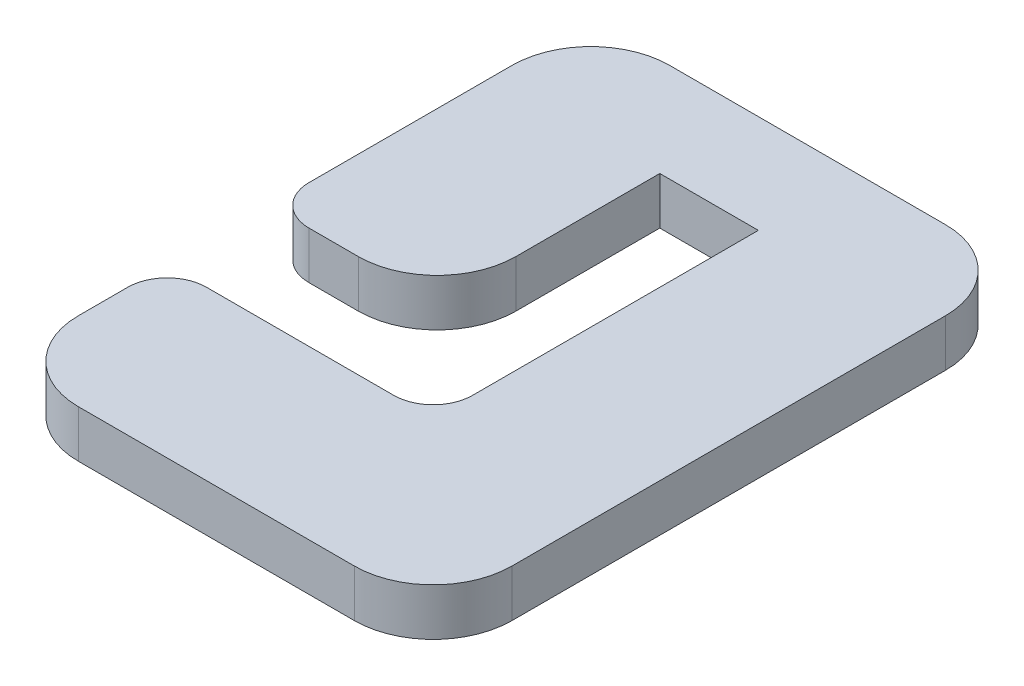
ISO-10303-21;
HEADER;
FILE_DESCRIPTION(('STEP AP214'),'2;1');
FILE_NAME('part.step','',(''),(''),'','','');
FILE_SCHEMA(('AUTOMOTIVE_DESIGN { 1 0 10303 214 1 1 1 1 }'));
ENDSEC;
DATA;
#1=APPLICATION_CONTEXT('core data for automotive mechanical design processes');
#2=APPLICATION_PROTOCOL_DEFINITION('international standard','automotive_design',2000,#1);
#3=PRODUCT_CONTEXT('',#1,'mechanical');
#4=PRODUCT('Part','Part','',(#3));
#5=PRODUCT_RELATED_PRODUCT_CATEGORY('part','',(#4));
#6=PRODUCT_DEFINITION_FORMATION('','',#4);
#7=PRODUCT_DEFINITION_CONTEXT('part definition',#1,'design');
#8=PRODUCT_DEFINITION('design','',#6,#7);
#9=PRODUCT_DEFINITION_SHAPE('','',#8);
#10=(LENGTH_UNIT() NAMED_UNIT(*) SI_UNIT(.MILLI.,.METRE.));
#11=(NAMED_UNIT(*) PLANE_ANGLE_UNIT() SI_UNIT($,.RADIAN.));
#12=(NAMED_UNIT(*) SI_UNIT($,.STERADIAN.) SOLID_ANGLE_UNIT());
#13=UNCERTAINTY_MEASURE_WITH_UNIT(LENGTH_MEASURE(1.E-05),#10,'distance_accuracy_value','');
#14=(GEOMETRIC_REPRESENTATION_CONTEXT(3) GLOBAL_UNCERTAINTY_ASSIGNED_CONTEXT((#13)) GLOBAL_UNIT_ASSIGNED_CONTEXT((#10,
#11,#12)) REPRESENTATION_CONTEXT('',''));
#15=CARTESIAN_POINT('',(0.,0.,0.));
#16=DIRECTION('',(0.,0.,1.));
#17=DIRECTION('',(1.,0.,0.));
#18=AXIS2_PLACEMENT_3D('',#15,#16,#17);
#19=CARTESIAN_POINT('',(11.,2.4,15.));
#20=DIRECTION('',(-1.,0.,0.));
#21=DIRECTION('',(0.,0.,1.));
#22=AXIS2_PLACEMENT_3D('',#19,#20,#21);
#23=PLANE('',#22);
#24=DIRECTION('',(0.,0.,-1.));
#25=VECTOR('',#24,1.);
#26=CARTESIAN_POINT('',(11.,2.4,15.));
#27=LINE('',#26,#25);
#28=CARTESIAN_POINT('',(11.,2.4,11.));
#29=VERTEX_POINT('',#28);
#30=CARTESIAN_POINT('',(11.,2.4,-11.));
#31=VERTEX_POINT('',#30);
#32=EDGE_CURVE('E244',#29,#31,#27,.T.);
#33=ORIENTED_EDGE('',*,*,#32,.F.);
#34=DIRECTION('',(0.,-1.,0.));
#35=VECTOR('',#34,1.);
#36=CARTESIAN_POINT('',(11.,2.4,11.));
#37=LINE('',#36,#35);
#38=CARTESIAN_POINT('',(11.,0.,11.));
#39=VERTEX_POINT('',#38);
#40=EDGE_CURVE('E298',#29,#39,#37,.T.);
#41=ORIENTED_EDGE('',*,*,#40,.T.);
#42=DIRECTION('',(0.,0.,-1.));
#43=VECTOR('',#42,1.);
#44=CARTESIAN_POINT('',(11.,0.,15.));
#45=LINE('',#44,#43);
#46=CARTESIAN_POINT('',(11.,0.,-11.));
#47=VERTEX_POINT('',#46);
#48=EDGE_CURVE('E210',#39,#47,#45,.T.);
#49=ORIENTED_EDGE('',*,*,#48,.T.);
#50=DIRECTION('',(0.,-1.,0.));
#51=VECTOR('',#50,1.);
#52=CARTESIAN_POINT('',(11.,2.4,-11.));
#53=LINE('',#52,#51);
#54=EDGE_CURVE('E295',#47,#31,#53,.F.);
#55=ORIENTED_EDGE('',*,*,#54,.T.);
#56=EDGE_LOOP('',(#33,#41,#49,#55));
#57=FACE_BOUND('',#56,.T.);
#58=ADVANCED_FACE('F38',(#57),#23,.F.);
#59=CARTESIAN_POINT('',(-11.,2.4,-15.));
#60=DIRECTION('',(0.,0.,1.));
#61=DIRECTION('',(1.,0.,0.));
#62=AXIS2_PLACEMENT_3D('',#59,#60,#61);
#63=PLANE('',#62);
#64=DIRECTION('',(-1.,0.,0.));
#65=VECTOR('',#64,1.);
#66=CARTESIAN_POINT('',(-11.,2.4,-15.));
#67=LINE('',#66,#65);
#68=CARTESIAN_POINT('',(7.,2.4,-15.));
#69=VERTEX_POINT('',#68);
#70=CARTESIAN_POINT('',(-7.,2.4,-15.));
#71=VERTEX_POINT('',#70);
#72=EDGE_CURVE('E388',#69,#71,#67,.T.);
#73=ORIENTED_EDGE('',*,*,#72,.F.);
#74=DIRECTION('',(0.,-1.,0.));
#75=VECTOR('',#74,1.);
#76=CARTESIAN_POINT('',(7.,2.4,-15.));
#77=LINE('',#76,#75);
#78=CARTESIAN_POINT('',(7.,0.,-15.));
#79=VERTEX_POINT('',#78);
#80=EDGE_CURVE('E305',#69,#79,#77,.T.);
#81=ORIENTED_EDGE('',*,*,#80,.T.);
#82=DIRECTION('',(-1.,0.,0.));
#83=VECTOR('',#82,1.);
#84=CARTESIAN_POINT('',(-11.,0.,-15.));
#85=LINE('',#84,#83);
#86=CARTESIAN_POINT('',(-7.,0.,-15.));
#87=VERTEX_POINT('',#86);
#88=EDGE_CURVE('E214',#79,#87,#85,.T.);
#89=ORIENTED_EDGE('',*,*,#88,.T.);
#90=DIRECTION('',(0.,-1.,0.));
#91=VECTOR('',#90,1.);
#92=CARTESIAN_POINT('',(-7.,2.4,-15.));
#93=LINE('',#92,#91);
#94=EDGE_CURVE('E302',#87,#71,#93,.F.);
#95=ORIENTED_EDGE('',*,*,#94,.T.);
#96=EDGE_LOOP('',(#73,#81,#89,#95));
#97=FACE_BOUND('',#96,.T.);
#98=ADVANCED_FACE('F413',(#97),#63,.F.);
#99=CARTESIAN_POINT('',(-11.,2.4,1.3));
#100=DIRECTION('',(1.,0.,0.));
#101=DIRECTION('',(0.,0.,-1.));
#102=AXIS2_PLACEMENT_3D('',#99,#100,#101);
#103=PLANE('',#102);
#104=DIRECTION('',(0.,0.,1.));
#105=VECTOR('',#104,1.);
#106=CARTESIAN_POINT('',(-11.,0.,1.3));
#107=LINE('',#106,#105);
#108=CARTESIAN_POINT('',(-11.,0.,-11.));
#109=VERTEX_POINT('',#108);
#110=CARTESIAN_POINT('',(-11.,0.,-0.699999999999996));
#111=VERTEX_POINT('',#110);
#112=EDGE_CURVE('E218',#109,#111,#107,.T.);
#113=ORIENTED_EDGE('',*,*,#112,.T.);
#114=DIRECTION('',(0.,-1.,0.));
#115=VECTOR('',#114,1.);
#116=CARTESIAN_POINT('',(-11.,2.4,-0.699999999999996));
#117=LINE('',#116,#115);
#118=CARTESIAN_POINT('',(-11.,2.4,-0.699999999999996));
#119=VERTEX_POINT('',#118);
#120=EDGE_CURVE('E62',#111,#119,#117,.F.);
#121=ORIENTED_EDGE('',*,*,#120,.T.);
#122=DIRECTION('',(0.,0.,1.));
#123=VECTOR('',#122,1.);
#124=CARTESIAN_POINT('',(-11.,2.4,1.3));
#125=LINE('',#124,#123);
#126=CARTESIAN_POINT('',(-11.,2.4,-11.));
#127=VERTEX_POINT('',#126);
#128=EDGE_CURVE('E392',#127,#119,#125,.T.);
#129=ORIENTED_EDGE('',*,*,#128,.F.);
#130=DIRECTION('',(0.,-1.,0.));
#131=VECTOR('',#130,1.);
#132=CARTESIAN_POINT('',(-11.,2.4,-11.));
#133=LINE('',#132,#131);
#134=EDGE_CURVE('E309',#127,#109,#133,.T.);
#135=ORIENTED_EDGE('',*,*,#134,.T.);
#136=EDGE_LOOP('',(#113,#121,#129,#135));
#137=FACE_BOUND('',#136,.T.);
#138=ADVANCED_FACE('F406',(#137),#103,.F.);
#139=CARTESIAN_POINT('',(-2.5,2.4,1.3));
#140=DIRECTION('',(0.,0.,-1.));
#141=DIRECTION('',(-1.,0.,0.));
#142=AXIS2_PLACEMENT_3D('',#139,#140,#141);
#143=PLANE('',#142);
#144=DIRECTION('',(1.,0.,0.));
#145=VECTOR('',#144,1.);
#146=CARTESIAN_POINT('',(-2.5,2.4,1.3));
#147=LINE('',#146,#145);
#148=CARTESIAN_POINT('',(-9.,2.4,1.3));
#149=VERTEX_POINT('',#148);
#150=CARTESIAN_POINT('',(-6.5,2.4,1.3));
#151=VERTEX_POINT('',#150);
#152=EDGE_CURVE('E177',#149,#151,#147,.T.);
#153=ORIENTED_EDGE('',*,*,#152,.F.);
#154=DIRECTION('',(0.,-1.,0.));
#155=VECTOR('',#154,1.);
#156=CARTESIAN_POINT('',(-9.,2.4,1.3));
#157=LINE('',#156,#155);
#158=CARTESIAN_POINT('',(-9.,0.,1.3));
#159=VERTEX_POINT('',#158);
#160=EDGE_CURVE('E338',#149,#159,#157,.T.);
#161=ORIENTED_EDGE('',*,*,#160,.T.);
#162=DIRECTION('',(1.,0.,0.));
#163=VECTOR('',#162,1.);
#164=CARTESIAN_POINT('',(-2.5,0.,1.3));
#165=LINE('',#164,#163);
#166=CARTESIAN_POINT('',(-6.5,0.,1.3));
#167=VERTEX_POINT('',#166);
#168=EDGE_CURVE('E221',#159,#167,#165,.T.);
#169=ORIENTED_EDGE('',*,*,#168,.T.);
#170=DIRECTION('',(0.,-1.,0.));
#171=VECTOR('',#170,1.);
#172=CARTESIAN_POINT('',(-6.5,2.4,1.3));
#173=LINE('',#172,#171);
#174=EDGE_CURVE('E253',#167,#151,#173,.F.);
#175=ORIENTED_EDGE('',*,*,#174,.T.);
#176=EDGE_LOOP('',(#153,#161,#169,#175));
#177=FACE_BOUND('',#176,.T.);
#178=ADVANCED_FACE('F400',(#177),#143,.F.);
#179=CARTESIAN_POINT('',(-2.5,2.4,-10.));
#180=DIRECTION('',(-1.,0.,0.));
#181=DIRECTION('',(0.,0.,1.));
#182=AXIS2_PLACEMENT_3D('',#179,#180,#181);
#183=PLANE('',#182);
#184=DIRECTION('',(0.,0.,-1.));
#185=VECTOR('',#184,1.);
#186=CARTESIAN_POINT('',(-2.5,2.4,-10.));
#187=LINE('',#186,#185);
#188=CARTESIAN_POINT('',(-2.5,2.4,-2.7));
#189=VERTEX_POINT('',#188);
#190=CARTESIAN_POINT('',(-2.5,2.4,-10.));
#191=VERTEX_POINT('',#190);
#192=EDGE_CURVE('E163',#189,#191,#187,.T.);
#193=ORIENTED_EDGE('',*,*,#192,.F.);
#194=DIRECTION('',(0.,-1.,0.));
#195=VECTOR('',#194,1.);
#196=CARTESIAN_POINT('',(-2.5,2.4,-2.7));
#197=LINE('',#196,#195);
#198=CARTESIAN_POINT('',(-2.5,0.,-2.7));
#199=VERTEX_POINT('',#198);
#200=EDGE_CURVE('E187',#189,#199,#197,.T.);
#201=ORIENTED_EDGE('',*,*,#200,.T.);
#202=DIRECTION('',(0.,0.,-1.));
#203=VECTOR('',#202,1.);
#204=CARTESIAN_POINT('',(-2.5,0.,-10.));
#205=LINE('',#204,#203);
#206=CARTESIAN_POINT('',(-2.5,0.,-10.));
#207=VERTEX_POINT('',#206);
#208=EDGE_CURVE('E183',#199,#207,#205,.T.);
#209=ORIENTED_EDGE('',*,*,#208,.T.);
#210=DIRECTION('',(0.,-1.,0.));
#211=VECTOR('',#210,1.);
#212=CARTESIAN_POINT('',(-2.5,2.4,-10.));
#213=LINE('',#212,#211);
#214=EDGE_CURVE('E180',#191,#207,#213,.T.);
#215=ORIENTED_EDGE('',*,*,#214,.F.);
#216=EDGE_LOOP('',(#193,#201,#209,#215));
#217=FACE_BOUND('',#216,.T.);
#218=ADVANCED_FACE('F181',(#217),#183,.F.);
#219=CARTESIAN_POINT('',(-2.5,2.4,-10.));
#220=DIRECTION('',(0.,0.,-1.));
#221=DIRECTION('',(-1.,0.,0.));
#222=AXIS2_PLACEMENT_3D('',#219,#220,#221);
#223=PLANE('',#222);
#224=DIRECTION('',(1.,0.,0.));
#225=VECTOR('',#224,1.);
#226=CARTESIAN_POINT('',(-2.5,0.,-10.));
#227=LINE('',#226,#225);
#228=CARTESIAN_POINT('',(2.5,0.,-10.));
#229=VERTEX_POINT('',#228);
#230=EDGE_CURVE('E226',#207,#229,#227,.T.);
#231=ORIENTED_EDGE('',*,*,#230,.T.);
#232=DIRECTION('',(0.,-1.,0.));
#233=VECTOR('',#232,1.);
#234=CARTESIAN_POINT('',(2.5,2.4,-10.));
#235=LINE('',#234,#233);
#236=CARTESIAN_POINT('',(2.5,2.4,-10.));
#237=VERTEX_POINT('',#236);
#238=EDGE_CURVE('E188',#237,#229,#235,.T.);
#239=ORIENTED_EDGE('',*,*,#238,.F.);
#240=DIRECTION('',(1.,0.,0.));
#241=VECTOR('',#240,1.);
#242=CARTESIAN_POINT('',(-2.5,2.4,-10.));
#243=LINE('',#242,#241);
#244=EDGE_CURVE('E169',#191,#237,#243,.T.);
#245=ORIENTED_EDGE('',*,*,#244,.F.);
#246=ORIENTED_EDGE('',*,*,#214,.T.);
#247=EDGE_LOOP('',(#231,#239,#245,#246));
#248=FACE_BOUND('',#247,.T.);
#249=ADVANCED_FACE('F190',(#248),#223,.F.);
#250=CARTESIAN_POINT('',(2.5,2.4,-10.));
#251=DIRECTION('',(1.,0.,0.));
#252=DIRECTION('',(0.,0.,-1.));
#253=AXIS2_PLACEMENT_3D('',#250,#251,#252);
#254=PLANE('',#253);
#255=DIRECTION('',(0.,0.,1.));
#256=VECTOR('',#255,1.);
#257=CARTESIAN_POINT('',(2.5,0.,-10.));
#258=LINE('',#257,#256);
#259=CARTESIAN_POINT('',(2.5,0.,4.5));
#260=VERTEX_POINT('',#259);
#261=EDGE_CURVE('E229',#229,#260,#258,.T.);
#262=ORIENTED_EDGE('',*,*,#261,.T.);
#263=DIRECTION('',(0.,-1.,0.));
#264=VECTOR('',#263,1.);
#265=CARTESIAN_POINT('',(2.5,2.4,4.5));
#266=LINE('',#265,#264);
#267=CARTESIAN_POINT('',(2.5,2.4,4.5));
#268=VERTEX_POINT('',#267);
#269=EDGE_CURVE('E320',#260,#268,#266,.F.);
#270=ORIENTED_EDGE('',*,*,#269,.T.);
#271=DIRECTION('',(0.,0.,1.));
#272=VECTOR('',#271,1.);
#273=CARTESIAN_POINT('',(2.5,2.4,-10.));
#274=LINE('',#273,#272);
#275=EDGE_CURVE('E194',#237,#268,#274,.T.);
#276=ORIENTED_EDGE('',*,*,#275,.F.);
#277=ORIENTED_EDGE('',*,*,#238,.T.);
#278=EDGE_LOOP('',(#262,#270,#276,#277));
#279=FACE_BOUND('',#278,.T.);
#280=ADVANCED_FACE('F353',(#279),#254,.F.);
#281=CARTESIAN_POINT('',(-2.5,2.4,6.5));
#282=DIRECTION('',(0.,0.,1.));
#283=DIRECTION('',(1.,0.,0.));
#284=AXIS2_PLACEMENT_3D('',#281,#282,#283);
#285=PLANE('',#284);
#286=DIRECTION('',(-1.,0.,0.));
#287=VECTOR('',#286,1.);
#288=CARTESIAN_POINT('',(-2.5,2.4,6.5));
#289=LINE('',#288,#287);
#290=CARTESIAN_POINT('',(0.5,2.4,6.5));
#291=VERTEX_POINT('',#290);
#292=CARTESIAN_POINT('',(-9.,2.4,6.50000000000001));
#293=VERTEX_POINT('',#292);
#294=EDGE_CURVE('E197',#291,#293,#289,.T.);
#295=ORIENTED_EDGE('',*,*,#294,.F.);
#296=DIRECTION('',(0.,-1.,0.));
#297=VECTOR('',#296,1.);
#298=CARTESIAN_POINT('',(0.5,0.,6.5));
#299=LINE('',#298,#297);
#300=CARTESIAN_POINT('',(0.5,0.,6.5));
#301=VERTEX_POINT('',#300);
#302=EDGE_CURVE('E316',#291,#301,#299,.T.);
#303=ORIENTED_EDGE('',*,*,#302,.T.);
#304=DIRECTION('',(-1.,0.,0.));
#305=VECTOR('',#304,1.);
#306=CARTESIAN_POINT('',(-2.5,0.,6.5));
#307=LINE('',#306,#305);
#308=CARTESIAN_POINT('',(-9.,0.,6.5));
#309=VERTEX_POINT('',#308);
#310=EDGE_CURVE('E233',#301,#309,#307,.T.);
#311=ORIENTED_EDGE('',*,*,#310,.T.);
#312=DIRECTION('',(0.,-1.,0.));
#313=VECTOR('',#312,1.);
#314=CARTESIAN_POINT('',(-9.,2.4,6.5));
#315=LINE('',#314,#313);
#316=EDGE_CURVE('E313',#309,#293,#315,.F.);
#317=ORIENTED_EDGE('',*,*,#316,.T.);
#318=EDGE_LOOP('',(#295,#303,#311,#317));
#319=FACE_BOUND('',#318,.T.);
#320=ADVANCED_FACE('F359',(#319),#285,.F.);
#321=CARTESIAN_POINT('',(-11.,2.4,15.));
#322=DIRECTION('',(1.,0.,0.));
#323=DIRECTION('',(0.,0.,-1.));
#324=AXIS2_PLACEMENT_3D('',#321,#322,#323);
#325=PLANE('',#324);
#326=DIRECTION('',(0.,0.,1.));
#327=VECTOR('',#326,1.);
#328=CARTESIAN_POINT('',(-11.,2.4,15.));
#329=LINE('',#328,#327);
#330=CARTESIAN_POINT('',(-11.,2.4,8.5));
#331=VERTEX_POINT('',#330);
#332=CARTESIAN_POINT('',(-11.,2.4,11.));
#333=VERTEX_POINT('',#332);
#334=EDGE_CURVE('E203',#331,#333,#329,.T.);
#335=ORIENTED_EDGE('',*,*,#334,.F.);
#336=DIRECTION('',(0.,-1.,0.));
#337=VECTOR('',#336,1.);
#338=CARTESIAN_POINT('',(-11.,2.4,8.5));
#339=LINE('',#338,#337);
#340=CARTESIAN_POINT('',(-11.,0.,8.5));
#341=VERTEX_POINT('',#340);
#342=EDGE_CURVE('E323',#331,#341,#339,.T.);
#343=ORIENTED_EDGE('',*,*,#342,.T.);
#344=DIRECTION('',(0.,0.,1.));
#345=VECTOR('',#344,1.);
#346=CARTESIAN_POINT('',(-11.,0.,15.));
#347=LINE('',#346,#345);
#348=CARTESIAN_POINT('',(-11.,0.,11.));
#349=VERTEX_POINT('',#348);
#350=EDGE_CURVE('E237',#341,#349,#347,.T.);
#351=ORIENTED_EDGE('',*,*,#350,.T.);
#352=DIRECTION('',(0.,-1.,0.));
#353=VECTOR('',#352,1.);
#354=CARTESIAN_POINT('',(-11.,2.4,11.));
#355=LINE('',#354,#353);
#356=EDGE_CURVE('E279',#349,#333,#355,.F.);
#357=ORIENTED_EDGE('',*,*,#356,.T.);
#358=EDGE_LOOP('',(#335,#343,#351,#357));
#359=FACE_BOUND('',#358,.T.);
#360=ADVANCED_FACE('F366',(#359),#325,.F.);
#361=CARTESIAN_POINT('',(-11.,2.4,15.));
#362=DIRECTION('',(0.,0.,-1.));
#363=DIRECTION('',(-1.,0.,0.));
#364=AXIS2_PLACEMENT_3D('',#361,#362,#363);
#365=PLANE('',#364);
#366=DIRECTION('',(1.,0.,0.));
#367=VECTOR('',#366,1.);
#368=CARTESIAN_POINT('',(-11.,2.4,15.));
#369=LINE('',#368,#367);
#370=CARTESIAN_POINT('',(-7.,2.4,15.));
#371=VERTEX_POINT('',#370);
#372=CARTESIAN_POINT('',(7.,2.4,15.));
#373=VERTEX_POINT('',#372);
#374=EDGE_CURVE('E206',#371,#373,#369,.T.);
#375=ORIENTED_EDGE('',*,*,#374,.F.);
#376=DIRECTION('',(0.,-1.,0.));
#377=VECTOR('',#376,1.);
#378=CARTESIAN_POINT('',(-7.,2.4,15.));
#379=LINE('',#378,#377);
#380=CARTESIAN_POINT('',(-7.,0.,15.));
#381=VERTEX_POINT('',#380);
#382=EDGE_CURVE('E262',#371,#381,#379,.T.);
#383=ORIENTED_EDGE('',*,*,#382,.T.);
#384=DIRECTION('',(1.,0.,0.));
#385=VECTOR('',#384,1.);
#386=CARTESIAN_POINT('',(-11.,0.,15.));
#387=LINE('',#386,#385);
#388=CARTESIAN_POINT('',(7.,0.,15.));
#389=VERTEX_POINT('',#388);
#390=EDGE_CURVE('E240',#381,#389,#387,.T.);
#391=ORIENTED_EDGE('',*,*,#390,.T.);
#392=DIRECTION('',(0.,-1.,0.));
#393=VECTOR('',#392,1.);
#394=CARTESIAN_POINT('',(7.,2.4,15.));
#395=LINE('',#394,#393);
#396=EDGE_CURVE('E259',#389,#373,#395,.F.);
#397=ORIENTED_EDGE('',*,*,#396,.T.);
#398=EDGE_LOOP('',(#375,#383,#391,#397));
#399=FACE_BOUND('',#398,.T.);
#400=ADVANCED_FACE('F375',(#399),#365,.F.);
#401=CARTESIAN_POINT('',(0.,2.4,0.));
#402=DIRECTION('',(0.,-1.,0.));
#403=DIRECTION('',(0.,0.,-1.));
#404=AXIS2_PLACEMENT_3D('',#401,#402,#403);
#405=PLANE('',#404);
#406=ORIENTED_EDGE('',*,*,#294,.T.);
#407=CARTESIAN_POINT('',(-9.,2.4,8.5));
#408=DIRECTION('',(0.,-1.,0.));
#409=DIRECTION('',(0.,0.,-1.));
#410=AXIS2_PLACEMENT_3D('',#407,#408,#409);
#411=CIRCLE('',#410,2.);
#412=EDGE_CURVE('E335',#293,#331,#411,.F.);
#413=ORIENTED_EDGE('',*,*,#412,.T.);
#414=ORIENTED_EDGE('',*,*,#334,.T.);
#415=CARTESIAN_POINT('',(-7.,2.4,11.));
#416=DIRECTION('',(0.,-1.,0.));
#417=DIRECTION('',(0.,0.,-1.));
#418=AXIS2_PLACEMENT_3D('',#415,#416,#417);
#419=CIRCLE('',#418,4.);
#420=EDGE_CURVE('E292',#333,#371,#419,.F.);
#421=ORIENTED_EDGE('',*,*,#420,.T.);
#422=ORIENTED_EDGE('',*,*,#374,.T.);
#423=CARTESIAN_POINT('',(7.,2.4,11.));
#424=DIRECTION('',(0.,-1.,0.));
#425=DIRECTION('',(0.,0.,-1.));
#426=AXIS2_PLACEMENT_3D('',#423,#424,#425);
#427=CIRCLE('',#426,4.);
#428=EDGE_CURVE('E289',#373,#29,#427,.F.);
#429=ORIENTED_EDGE('',*,*,#428,.T.);
#430=ORIENTED_EDGE('',*,*,#32,.T.);
#431=CARTESIAN_POINT('',(7.,2.4,-11.));
#432=DIRECTION('',(0.,-1.,0.));
#433=DIRECTION('',(0.,0.,-1.));
#434=AXIS2_PLACEMENT_3D('',#431,#432,#433);
#435=CIRCLE('',#434,4.);
#436=EDGE_CURVE('E286',#31,#69,#435,.F.);
#437=ORIENTED_EDGE('',*,*,#436,.T.);
#438=ORIENTED_EDGE('',*,*,#72,.T.);
#439=CARTESIAN_POINT('',(-7.,2.4,-11.));
#440=DIRECTION('',(0.,-1.,0.));
#441=DIRECTION('',(0.,0.,-1.));
#442=AXIS2_PLACEMENT_3D('',#439,#440,#441);
#443=CIRCLE('',#442,4.);
#444=EDGE_CURVE('E283',#71,#127,#443,.F.);
#445=ORIENTED_EDGE('',*,*,#444,.T.);
#446=ORIENTED_EDGE('',*,*,#128,.T.);
#447=CARTESIAN_POINT('',(-9.,2.4,-0.699999999999997));
#448=DIRECTION('',(0.,-1.,0.));
#449=DIRECTION('',(0.,0.,-1.));
#450=AXIS2_PLACEMENT_3D('',#447,#448,#449);
#451=CIRCLE('',#450,2.);
#452=EDGE_CURVE('E54',#119,#149,#451,.F.);
#453=ORIENTED_EDGE('',*,*,#452,.T.);
#454=ORIENTED_EDGE('',*,*,#152,.T.);
#455=CARTESIAN_POINT('',(-6.5,2.4,-2.7));
#456=DIRECTION('',(0.,-1.,0.));
#457=DIRECTION('',(0.,0.,-1.));
#458=AXIS2_PLACEMENT_3D('',#455,#456,#457);
#459=CIRCLE('',#458,4.);
#460=EDGE_CURVE('E172',#151,#189,#459,.F.);
#461=ORIENTED_EDGE('',*,*,#460,.T.);
#462=ORIENTED_EDGE('',*,*,#192,.T.);
#463=ORIENTED_EDGE('',*,*,#244,.T.);
#464=ORIENTED_EDGE('',*,*,#275,.T.);
#465=CARTESIAN_POINT('',(0.5,2.4,4.5));
#466=DIRECTION('',(0.,-1.,0.));
#467=DIRECTION('',(0.,0.,-1.));
#468=AXIS2_PLACEMENT_3D('',#465,#466,#467);
#469=CIRCLE('',#468,2.);
#470=EDGE_CURVE('E11',#268,#291,#469,.T.);
#471=ORIENTED_EDGE('',*,*,#470,.T.);
#472=EDGE_LOOP('',(#406,#413,#414,#421,#422,#429,#430,#437,#438,#445,#446,#453,#454,#461,#462,
#463,#464,#471));
#473=FACE_BOUND('',#472,.T.);
#474=ADVANCED_FACE('F166',(#473),#405,.F.);
#475=CARTESIAN_POINT('',(0.,0.,0.));
#476=DIRECTION('',(0.,-1.,0.));
#477=DIRECTION('',(0.,0.,-1.));
#478=AXIS2_PLACEMENT_3D('',#475,#476,#477);
#479=PLANE('',#478);
#480=ORIENTED_EDGE('',*,*,#350,.F.);
#481=CARTESIAN_POINT('',(-9.,0.,8.5));
#482=DIRECTION('',(0.,-1.,0.));
#483=DIRECTION('',(0.,0.,-1.));
#484=AXIS2_PLACEMENT_3D('',#481,#482,#483);
#485=CIRCLE('',#484,2.);
#486=EDGE_CURVE('E330',#341,#309,#485,.T.);
#487=ORIENTED_EDGE('',*,*,#486,.T.);
#488=ORIENTED_EDGE('',*,*,#310,.F.);
#489=CARTESIAN_POINT('',(0.5,0.,4.5));
#490=DIRECTION('',(0.,-1.,0.));
#491=DIRECTION('',(0.,0.,-1.));
#492=AXIS2_PLACEMENT_3D('',#489,#490,#491);
#493=CIRCLE('',#492,2.);
#494=EDGE_CURVE('E47',#301,#260,#493,.F.);
#495=ORIENTED_EDGE('',*,*,#494,.T.);
#496=ORIENTED_EDGE('',*,*,#261,.F.);
#497=ORIENTED_EDGE('',*,*,#230,.F.);
#498=ORIENTED_EDGE('',*,*,#208,.F.);
#499=CARTESIAN_POINT('',(-6.5,0.,-2.7));
#500=DIRECTION('',(0.,-1.,0.));
#501=DIRECTION('',(0.,0.,-1.));
#502=AXIS2_PLACEMENT_3D('',#499,#500,#501);
#503=CIRCLE('',#502,4.);
#504=EDGE_CURVE('E249',#199,#167,#503,.T.);
#505=ORIENTED_EDGE('',*,*,#504,.T.);
#506=ORIENTED_EDGE('',*,*,#168,.F.);
#507=CARTESIAN_POINT('',(-9.,0.,-0.699999999999997));
#508=DIRECTION('',(0.,-1.,0.));
#509=DIRECTION('',(0.,0.,-1.));
#510=AXIS2_PLACEMENT_3D('',#507,#508,#509);
#511=CIRCLE('',#510,2.);
#512=EDGE_CURVE('E327',#159,#111,#511,.T.);
#513=ORIENTED_EDGE('',*,*,#512,.T.);
#514=ORIENTED_EDGE('',*,*,#112,.F.);
#515=CARTESIAN_POINT('',(-7.,0.,-11.));
#516=DIRECTION('',(0.,-1.,0.));
#517=DIRECTION('',(0.,0.,-1.));
#518=AXIS2_PLACEMENT_3D('',#515,#516,#517);
#519=CIRCLE('',#518,4.);
#520=EDGE_CURVE('E266',#109,#87,#519,.T.);
#521=ORIENTED_EDGE('',*,*,#520,.T.);
#522=ORIENTED_EDGE('',*,*,#88,.F.);
#523=CARTESIAN_POINT('',(7.,0.,-11.));
#524=DIRECTION('',(0.,-1.,0.));
#525=DIRECTION('',(0.,0.,-1.));
#526=AXIS2_PLACEMENT_3D('',#523,#524,#525);
#527=CIRCLE('',#526,4.);
#528=EDGE_CURVE('E269',#79,#47,#527,.T.);
#529=ORIENTED_EDGE('',*,*,#528,.T.);
#530=ORIENTED_EDGE('',*,*,#48,.F.);
#531=CARTESIAN_POINT('',(7.,0.,11.));
#532=DIRECTION('',(0.,-1.,0.));
#533=DIRECTION('',(0.,0.,-1.));
#534=AXIS2_PLACEMENT_3D('',#531,#532,#533);
#535=CIRCLE('',#534,4.);
#536=EDGE_CURVE('E272',#39,#389,#535,.T.);
#537=ORIENTED_EDGE('',*,*,#536,.T.);
#538=ORIENTED_EDGE('',*,*,#390,.F.);
#539=CARTESIAN_POINT('',(-7.,0.,11.));
#540=DIRECTION('',(0.,-1.,0.));
#541=DIRECTION('',(0.,0.,-1.));
#542=AXIS2_PLACEMENT_3D('',#539,#540,#541);
#543=CIRCLE('',#542,4.);
#544=EDGE_CURVE('E275',#381,#349,#543,.T.);
#545=ORIENTED_EDGE('',*,*,#544,.T.);
#546=EDGE_LOOP('',(#480,#487,#488,#495,#496,#497,#498,#505,#506,#513,#514,#521,#522,#529,#530,
#537,#538,#545));
#547=FACE_BOUND('',#546,.T.);
#548=ADVANCED_FACE('F348',(#547),#479,.T.);
#549=CARTESIAN_POINT('',(-6.5,2.4,-2.7));
#550=DIRECTION('',(0.,-1.,0.));
#551=DIRECTION('',(0.,0.,-1.));
#552=AXIS2_PLACEMENT_3D('',#549,#550,#551);
#553=CYLINDRICAL_SURFACE('',#552,4.);
#554=ORIENTED_EDGE('',*,*,#460,.F.);
#555=ORIENTED_EDGE('',*,*,#174,.F.);
#556=ORIENTED_EDGE('',*,*,#504,.F.);
#557=ORIENTED_EDGE('',*,*,#200,.F.);
#558=EDGE_LOOP('',(#554,#555,#556,#557));
#559=FACE_BOUND('',#558,.T.);
#560=ADVANCED_FACE('F403',(#559),#553,.T.);
#561=CARTESIAN_POINT('',(-7.,2.4,11.));
#562=DIRECTION('',(0.,-1.,0.));
#563=DIRECTION('',(0.,0.,-1.));
#564=AXIS2_PLACEMENT_3D('',#561,#562,#563);
#565=CYLINDRICAL_SURFACE('',#564,4.);
#566=ORIENTED_EDGE('',*,*,#420,.F.);
#567=ORIENTED_EDGE('',*,*,#356,.F.);
#568=ORIENTED_EDGE('',*,*,#544,.F.);
#569=ORIENTED_EDGE('',*,*,#382,.F.);
#570=EDGE_LOOP('',(#566,#567,#568,#569));
#571=FACE_BOUND('',#570,.T.);
#572=ADVANCED_FACE('F371',(#571),#565,.T.);
#573=CARTESIAN_POINT('',(7.,2.4,11.));
#574=DIRECTION('',(0.,-1.,0.));
#575=DIRECTION('',(0.,0.,-1.));
#576=AXIS2_PLACEMENT_3D('',#573,#574,#575);
#577=CYLINDRICAL_SURFACE('',#576,4.);
#578=ORIENTED_EDGE('',*,*,#428,.F.);
#579=ORIENTED_EDGE('',*,*,#396,.F.);
#580=ORIENTED_EDGE('',*,*,#536,.F.);
#581=ORIENTED_EDGE('',*,*,#40,.F.);
#582=EDGE_LOOP('',(#578,#579,#580,#581));
#583=FACE_BOUND('',#582,.T.);
#584=ADVANCED_FACE('F379',(#583),#577,.T.);
#585=CARTESIAN_POINT('',(7.,2.4,-11.));
#586=DIRECTION('',(0.,-1.,0.));
#587=DIRECTION('',(0.,0.,-1.));
#588=AXIS2_PLACEMENT_3D('',#585,#586,#587);
#589=CYLINDRICAL_SURFACE('',#588,4.);
#590=ORIENTED_EDGE('',*,*,#436,.F.);
#591=ORIENTED_EDGE('',*,*,#54,.F.);
#592=ORIENTED_EDGE('',*,*,#528,.F.);
#593=ORIENTED_EDGE('',*,*,#80,.F.);
#594=EDGE_LOOP('',(#590,#591,#592,#593));
#595=FACE_BOUND('',#594,.T.);
#596=ADVANCED_FACE('F428',(#595),#589,.T.);
#597=CARTESIAN_POINT('',(-7.,2.4,-11.));
#598=DIRECTION('',(0.,-1.,0.));
#599=DIRECTION('',(0.,0.,-1.));
#600=AXIS2_PLACEMENT_3D('',#597,#598,#599);
#601=CYLINDRICAL_SURFACE('',#600,4.);
#602=ORIENTED_EDGE('',*,*,#444,.F.);
#603=ORIENTED_EDGE('',*,*,#94,.F.);
#604=ORIENTED_EDGE('',*,*,#520,.F.);
#605=ORIENTED_EDGE('',*,*,#134,.F.);
#606=EDGE_LOOP('',(#602,#603,#604,#605));
#607=FACE_BOUND('',#606,.T.);
#608=ADVANCED_FACE('F431',(#607),#601,.T.);
#609=CARTESIAN_POINT('',(0.5,2.4,4.5));
#610=DIRECTION('',(0.,1.,0.));
#611=DIRECTION('',(0.,0.,1.));
#612=AXIS2_PLACEMENT_3D('',#609,#610,#611);
#613=CYLINDRICAL_SURFACE('',#612,2.);
#614=ORIENTED_EDGE('',*,*,#470,.F.);
#615=ORIENTED_EDGE('',*,*,#269,.F.);
#616=ORIENTED_EDGE('',*,*,#494,.F.);
#617=ORIENTED_EDGE('',*,*,#302,.F.);
#618=EDGE_LOOP('',(#614,#615,#616,#617));
#619=FACE_BOUND('',#618,.T.);
#620=ADVANCED_FACE('F355',(#619),#613,.F.);
#621=CARTESIAN_POINT('',(-9.,2.4,8.5));
#622=DIRECTION('',(0.,-1.,0.));
#623=DIRECTION('',(0.,0.,-1.));
#624=AXIS2_PLACEMENT_3D('',#621,#622,#623);
#625=CYLINDRICAL_SURFACE('',#624,2.);
#626=ORIENTED_EDGE('',*,*,#412,.F.);
#627=ORIENTED_EDGE('',*,*,#316,.F.);
#628=ORIENTED_EDGE('',*,*,#486,.F.);
#629=ORIENTED_EDGE('',*,*,#342,.F.);
#630=EDGE_LOOP('',(#626,#627,#628,#629));
#631=FACE_BOUND('',#630,.T.);
#632=ADVANCED_FACE('F362',(#631),#625,.T.);
#633=CARTESIAN_POINT('',(-9.,2.4,-0.699999999999997));
#634=DIRECTION('',(0.,-1.,0.));
#635=DIRECTION('',(0.,0.,-1.));
#636=AXIS2_PLACEMENT_3D('',#633,#634,#635);
#637=CYLINDRICAL_SURFACE('',#636,2.);
#638=ORIENTED_EDGE('',*,*,#452,.F.);
#639=ORIENTED_EDGE('',*,*,#120,.F.);
#640=ORIENTED_EDGE('',*,*,#512,.F.);
#641=ORIENTED_EDGE('',*,*,#160,.F.);
#642=EDGE_LOOP('',(#638,#639,#640,#641));
#643=FACE_BOUND('',#642,.T.);
#644=ADVANCED_FACE('F40',(#643),#637,.T.);
#645=CLOSED_SHELL('',(#58,#98,#138,#178,#218,#249,#280,#320,#360,#400,#474,#548,#560,#572,#584,
#596,#608,#620,#632,#644));
#646=MANIFOLD_SOLID_BREP('B2',#645);
#647=ADVANCED_BREP_SHAPE_REPRESENTATION('',(#18,#646),#14);
#648=SHAPE_DEFINITION_REPRESENTATION(#9,#647);
ENDSEC;
END-ISO-10303-21;
